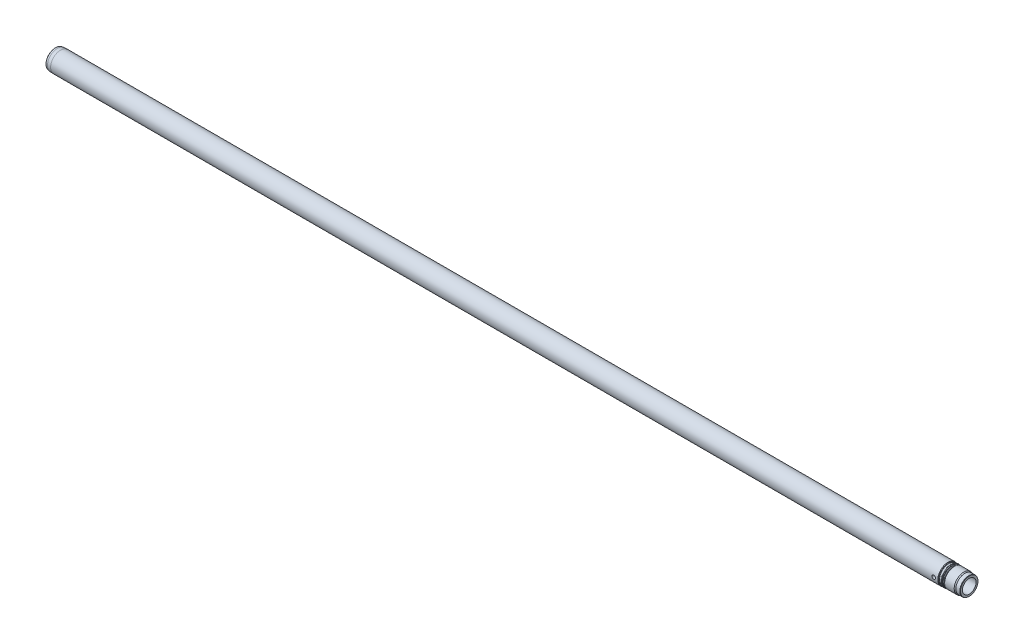
ISO-10303-21;
HEADER;
FILE_DESCRIPTION(('STEP AP214'),'2;1');
FILE_NAME('part.step','',(''),(''),'','','');
FILE_SCHEMA(('AUTOMOTIVE_DESIGN { 1 0 10303 214 1 1 1 1 }'));
ENDSEC;
DATA;
#1=APPLICATION_CONTEXT('core data for automotive mechanical design processes');
#2=APPLICATION_PROTOCOL_DEFINITION('international standard','automotive_design',2000,#1);
#3=PRODUCT_CONTEXT('',#1,'mechanical');
#4=PRODUCT('Part','Part','',(#3));
#5=PRODUCT_RELATED_PRODUCT_CATEGORY('part','',(#4));
#6=PRODUCT_DEFINITION_FORMATION('','',#4);
#7=PRODUCT_DEFINITION_CONTEXT('part definition',#1,'design');
#8=PRODUCT_DEFINITION('design','',#6,#7);
#9=PRODUCT_DEFINITION_SHAPE('','',#8);
#10=(LENGTH_UNIT() NAMED_UNIT(*) SI_UNIT(.MILLI.,.METRE.));
#11=(NAMED_UNIT(*) PLANE_ANGLE_UNIT() SI_UNIT($,.RADIAN.));
#12=(NAMED_UNIT(*) SI_UNIT($,.STERADIAN.) SOLID_ANGLE_UNIT());
#13=UNCERTAINTY_MEASURE_WITH_UNIT(LENGTH_MEASURE(1.E-05),#10,'distance_accuracy_value','');
#14=(GEOMETRIC_REPRESENTATION_CONTEXT(3) GLOBAL_UNCERTAINTY_ASSIGNED_CONTEXT((#13)) GLOBAL_UNIT_ASSIGNED_CONTEXT((#10,
#11,#12)) REPRESENTATION_CONTEXT('',''));
#15=CARTESIAN_POINT('',(0.,0.,0.));
#16=DIRECTION('',(0.,0.,1.));
#17=DIRECTION('',(1.,0.,0.));
#18=AXIS2_PLACEMENT_3D('',#15,#16,#17);
#19=CARTESIAN_POINT('',(0.,0.,0.));
#20=DIRECTION('',(-1.,0.,0.));
#21=DIRECTION('',(0.,0.,1.));
#22=AXIS2_PLACEMENT_3D('',#19,#20,#21);
#23=CONICAL_SURFACE('',#22,21.,0.5235987755983);
#24=CARTESIAN_POINT('',(6.9282032302755,0.,0.));
#25=DIRECTION('',(-1.,0.,0.));
#26=DIRECTION('',(0.,0.,1.));
#27=AXIS2_PLACEMENT_3D('',#24,#25,#26);
#28=CIRCLE('',#27,17.);
#29=CARTESIAN_POINT('',(6.9282032302755,0.,17.));
#30=VERTEX_POINT('',#29);
#31=EDGE_CURVE('E10',#30,#30,#28,.T.);
#32=ORIENTED_EDGE('',*,*,#31,.F.);
#33=EDGE_LOOP('',(#32));
#34=FACE_BOUND('',#33,.T.);
#35=CARTESIAN_POINT('',(0.,0.,0.));
#36=DIRECTION('',(-1.,0.,0.));
#37=DIRECTION('',(0.,0.,1.));
#38=AXIS2_PLACEMENT_3D('',#35,#36,#37);
#39=CIRCLE('',#38,21.);
#40=CARTESIAN_POINT('',(0.,0.,21.));
#41=VERTEX_POINT('',#40);
#42=EDGE_CURVE('E186',#41,#41,#39,.T.);
#43=ORIENTED_EDGE('',*,*,#42,.T.);
#44=EDGE_LOOP('',(#43));
#45=FACE_BOUND('',#44,.T.);
#46=ADVANCED_FACE('F43',(#34,#45),#23,.F.);
#47=CARTESIAN_POINT('',(0.,0.,0.));
#48=DIRECTION('',(-1.,0.,0.));
#49=DIRECTION('',(0.,0.,1.));
#50=AXIS2_PLACEMENT_3D('',#47,#48,#49);
#51=CYLINDRICAL_SURFACE('',#50,17.);
#52=CARTESIAN_POINT('',(2224.5,0.,17.));
#53=CARTESIAN_POINT('',(2224.4999939727,0.248139786094188,16.9999961954987));
#54=CARTESIAN_POINT('',(2224.47940671072,0.496344480536865,16.9945135114711));
#55=CARTESIAN_POINT('',(2224.39774465018,0.985608207524356,16.9731743158839));
#56=CARTESIAN_POINT('',(2224.33664995094,1.22666366691603,16.9573127053678));
#57=CARTESIAN_POINT('',(2224.17609514792,1.69449551647206,16.9169670511542));
#58=CARTESIAN_POINT('',(2224.07668410305,1.92128973608239,16.8924940366699));
#59=CARTESIAN_POINT('',(2223.8424992788,2.35498604639736,16.8375143452414));
#60=CARTESIAN_POINT('',(2223.70772328063,2.5618868878872,16.8070072897538));
#61=CARTESIAN_POINT('',(2223.40337915686,2.95465619368824,16.742475132348));
#62=CARTESIAN_POINT('',(2223.23315265612,3.14000475166011,16.7083905935436));
#63=CARTESIAN_POINT('',(2222.86414729992,3.47988446560821,16.6409282417729));
#64=CARTESIAN_POINT('',(2222.66536483098,3.63441171550888,16.607550518862));
#65=CARTESIAN_POINT('',(2222.24075395446,3.91078648059985,16.5446740227616));
#66=CARTESIAN_POINT('',(2222.01452540905,4.03203787997951,16.5152502963799));
#67=CARTESIAN_POINT('',(2221.54398909092,4.23458020510498,16.4644862931427));
#68=CARTESIAN_POINT('',(2221.29968460691,4.31587837939242,16.4431445501692));
#69=CARTESIAN_POINT('',(2220.80568432275,4.43440473399746,16.4115742230543));
#70=CARTESIAN_POINT('',(2220.55622997909,4.47257460052638,16.4011085907811));
#71=CARTESIAN_POINT('',(2220.05425585675,4.50669636392588,16.3917670522187));
#72=CARTESIAN_POINT('',(2219.80173665031,4.50265602438466,16.3928890146597));
#73=CARTESIAN_POINT('',(2219.30813487029,4.45322011969829,16.4063836229732));
#74=CARTESIAN_POINT('',(2219.06692858361,4.40896191779178,16.4184468321884));
#75=CARTESIAN_POINT('',(2218.59549324367,4.28216736951909,16.4519695301457));
#76=CARTESIAN_POINT('',(2218.36526505785,4.19962800383794,16.4734297600429));
#77=CARTESIAN_POINT('',(2217.91934632075,3.99768222492809,16.523602001098));
#78=CARTESIAN_POINT('',(2217.70384627049,3.87787539054613,16.5523921271919));
#79=CARTESIAN_POINT('',(2217.29560838492,3.60507498121206,16.6139379943505));
#80=CARTESIAN_POINT('',(2217.10287498213,3.45207496016856,16.6466945051375));
#81=CARTESIAN_POINT('',(2216.73914078256,3.11140669080729,16.713772135603));
#82=CARTESIAN_POINT('',(2216.5690368451,2.92278277301686,16.7481097163476));
#83=CARTESIAN_POINT('',(2216.2626934722,2.51926736973084,16.8135364031182));
#84=CARTESIAN_POINT('',(2216.12645533296,2.30437487928068,16.8446253847784));
#85=CARTESIAN_POINT('',(2215.89132397923,1.85304666357204,16.9002386163944));
#86=CARTESIAN_POINT('',(2215.79259105471,1.61652371530395,16.9247345619698));
#87=CARTESIAN_POINT('',(2215.63654666082,1.12944054429492,16.9641969693574));
#88=CARTESIAN_POINT('',(2215.57922627709,0.878883355042779,16.9791654819339));
#89=CARTESIAN_POINT('',(2215.50903761317,0.378499758438339,16.9975771452599));
#90=CARTESIAN_POINT('',(2215.49494974273,0.128855796723682,17.0013364198685));
#91=CARTESIAN_POINT('',(2215.50826073824,-0.369227077901234,16.9978138879051));
#92=CARTESIAN_POINT('',(2215.53565538363,-0.617666110824332,16.9905332045683));
#93=CARTESIAN_POINT('',(2215.63015281242,-1.10194782952378,16.9659528174809));
#94=CARTESIAN_POINT('',(2215.69657714815,-1.33793239097633,16.948824402433));
#95=CARTESIAN_POINT('',(2215.86646212655,-1.79538752946404,16.9064898967348));
#96=CARTESIAN_POINT('',(2215.96992675219,-2.0168565426002,16.8812829374232));
#97=CARTESIAN_POINT('',(2216.21322970176,-2.44374648563431,16.8248446875655));
#98=CARTESIAN_POINT('',(2216.35373386753,-2.64877339136345,16.7935061472465));
#99=CARTESIAN_POINT('',(2216.66628874917,-3.03276827772532,16.7284282285678));
#100=CARTESIAN_POINT('',(2216.83834560154,-3.21173117715732,16.6946883839752));
#101=CARTESIAN_POINT('',(2217.21480997561,-3.54364355494941,16.6274504542847));
#102=CARTESIAN_POINT('',(2217.41998287879,-3.69573311976482,16.5939850732425));
#103=CARTESIAN_POINT('',(2217.8536440921,-3.96333980003506,16.5321164485773));
#104=CARTESIAN_POINT('',(2218.08213141823,-4.07885845816123,16.5037129914492));
#105=CARTESIAN_POINT('',(2218.55478257722,-4.26917454350183,16.4555094596446));
#106=CARTESIAN_POINT('',(2218.79884568015,-4.34420881494308,16.4356594855548));
#107=CARTESIAN_POINT('',(2219.29673856418,-4.45199494844995,16.406794736422));
#108=CARTESIAN_POINT('',(2219.55056587738,-4.48475742334335,16.397777241798));
#109=CARTESIAN_POINT('',(2220.05198474975,-4.50646611717172,16.3918232507794));
#110=CARTESIAN_POINT('',(2220.29951289327,-4.49679348202494,16.3945059290146));
#111=CARTESIAN_POINT('',(2220.78927335167,-4.43710513576492,16.4107597380705));
#112=CARTESIAN_POINT('',(2221.03150579891,-4.3870904341136,16.424330596441));
#113=CARTESIAN_POINT('',(2221.50208906434,-4.24893296579963,16.4606067002153));
#114=CARTESIAN_POINT('',(2221.73053032532,-4.16107880659365,16.4832427143121));
#115=CARTESIAN_POINT('',(2222.16960250499,-3.94996082547752,16.5351012194014));
#116=CARTESIAN_POINT('',(2222.38023066107,-3.82669152406759,16.5643247294733));
#117=CARTESIAN_POINT('',(2222.78430015737,-3.54403917830613,16.6271251137983));
#118=CARTESIAN_POINT('',(2222.97706513554,-3.38371171107488,16.6608037314858));
#119=CARTESIAN_POINT('',(2223.33340368922,-3.03329563019939,16.7281467874236));
#120=CARTESIAN_POINT('',(2223.49697017825,-2.84319981272947,16.7618112202589));
#121=CARTESIAN_POINT('',(2223.79363954504,-2.43382938444725,16.826177392179));
#122=CARTESIAN_POINT('',(2223.92603111348,-2.21402616883131,16.8568021342467));
#123=CARTESIAN_POINT('',(2224.15177475838,-1.75448140910157,16.9107999106154));
#124=CARTESIAN_POINT('',(2224.24515224208,-1.51475296330053,16.9341776618239));
#125=CARTESIAN_POINT('',(2224.37783337599,-1.0632142420448,16.9679716718454));
#126=CARTESIAN_POINT('',(2224.42354035917,-0.853375925202503,16.9798953831305));
#127=CARTESIAN_POINT('',(2224.48462482595,-0.429040947974681,16.9959108172613));
#128=CARTESIAN_POINT('',(2224.50000521128,-0.214544735254492,17.000003289419));
#129=CARTESIAN_POINT('',(2224.5,0.,17.));
#130=B_SPLINE_CURVE_WITH_KNOTS('',3,(#52,#53,#54,#55,#56,#57,#58,#59,#60,#61,#62,#63,#64,#65,
#66,#67,#68,#69,#70,#71,#72,#73,#74,#75,#76,#77,#78,#79,#80,#81,#82,#83,#84,#85,#86,#87,#88,#89,
#90,#91,#92,#93,#94,#95,#96,#97,#98,#99,#100,#101,#102,#103,#104,#105,#106,#107,#108,#109,#110,
#111,#112,#113,#114,#115,#116,#117,#118,#119,#120,#121,#122,#123,#124,#125,#126,#127,#128,#129),
.UNSPECIFIED.,.T.,.F.,(4,2,2,2,2,2,2,2,2,2,2,2,2,2,2,2,2,2,2,2,2,2,2,2,2,2,2,2,2,2,2,2,2,2,2,2,
2,2,4),(0.,0.743632635950748,1.48763087813262,2.23067967867761,2.97377510891816,
3.73214910607012,4.49061915321903,5.26190121593442,6.03304329655962,6.78700122339545,
7.54082047960318,8.27396339050142,9.00716413574138,9.74853201191116,10.4900439902362,
11.2553725952916,12.0207304886276,12.7893235247107,13.5577510664168,14.3042921594799,
15.0507573025269,15.7846153421825,16.5185523178614,17.2667079864015,18.0150093138617,
18.7840807596342,19.5531197593254,20.3176095059617,21.0819072811555,21.8215171089269,
22.5611084303385,23.2951559815246,24.0293171671978,24.7847891506871,25.5404442388059,
26.3119567618966,27.0829660649108,27.7259815891753,28.3689355850576),.UNSPECIFIED.);
#131=CARTESIAN_POINT('',(2224.5,0.,17.));
#132=VERTEX_POINT('',#131);
#133=EDGE_CURVE('E90',#132,#132,#130,.T.);
#134=ORIENTED_EDGE('',*,*,#133,.T.);
#135=EDGE_LOOP('',(#134));
#136=FACE_BOUND('',#135,.T.);
#137=CARTESIAN_POINT('',(2224.5,0.,-17.));
#138=CARTESIAN_POINT('',(2224.4999939727,-0.248139786094188,-16.9999961954987));
#139=CARTESIAN_POINT('',(2224.47940671072,-0.496344480536865,-16.9945135114711));
#140=CARTESIAN_POINT('',(2224.39774465018,-0.985608207524356,-16.9731743158839));
#141=CARTESIAN_POINT('',(2224.33664995094,-1.22666366691603,-16.9573127053678));
#142=CARTESIAN_POINT('',(2224.17609514792,-1.69449551647206,-16.9169670511542));
#143=CARTESIAN_POINT('',(2224.07668410305,-1.92128973608239,-16.8924940366699));
#144=CARTESIAN_POINT('',(2223.8424992788,-2.35498604639736,-16.8375143452414));
#145=CARTESIAN_POINT('',(2223.70772328063,-2.5618868878872,-16.8070072897538));
#146=CARTESIAN_POINT('',(2223.40337915686,-2.95465619368824,-16.742475132348));
#147=CARTESIAN_POINT('',(2223.23315265612,-3.14000475166011,-16.7083905935436));
#148=CARTESIAN_POINT('',(2222.86414729992,-3.47988446560821,-16.6409282417729));
#149=CARTESIAN_POINT('',(2222.66536483098,-3.63441171550888,-16.607550518862));
#150=CARTESIAN_POINT('',(2222.24075395446,-3.91078648059985,-16.5446740227616));
#151=CARTESIAN_POINT('',(2222.01452540905,-4.03203787997951,-16.5152502963799));
#152=CARTESIAN_POINT('',(2221.54398909092,-4.23458020510498,-16.4644862931427));
#153=CARTESIAN_POINT('',(2221.29968460691,-4.31587837939242,-16.4431445501692));
#154=CARTESIAN_POINT('',(2220.80568432275,-4.43440473399746,-16.4115742230543));
#155=CARTESIAN_POINT('',(2220.55622997909,-4.47257460052638,-16.4011085907811));
#156=CARTESIAN_POINT('',(2220.05425585675,-4.50669636392588,-16.3917670522187));
#157=CARTESIAN_POINT('',(2219.80173665031,-4.50265602438466,-16.3928890146597));
#158=CARTESIAN_POINT('',(2219.30813487029,-4.45322011969829,-16.4063836229732));
#159=CARTESIAN_POINT('',(2219.06692858361,-4.40896191779178,-16.4184468321884));
#160=CARTESIAN_POINT('',(2218.59549324367,-4.28216736951909,-16.4519695301457));
#161=CARTESIAN_POINT('',(2218.36526505785,-4.19962800383794,-16.4734297600429));
#162=CARTESIAN_POINT('',(2217.91934632075,-3.99768222492809,-16.523602001098));
#163=CARTESIAN_POINT('',(2217.70384627049,-3.87787539054613,-16.5523921271919));
#164=CARTESIAN_POINT('',(2217.29560838492,-3.60507498121206,-16.6139379943505));
#165=CARTESIAN_POINT('',(2217.10287498213,-3.45207496016856,-16.6466945051375));
#166=CARTESIAN_POINT('',(2216.73914078256,-3.11140669080729,-16.713772135603));
#167=CARTESIAN_POINT('',(2216.5690368451,-2.92278277301686,-16.7481097163476));
#168=CARTESIAN_POINT('',(2216.2626934722,-2.51926736973084,-16.8135364031182));
#169=CARTESIAN_POINT('',(2216.12645533296,-2.30437487928068,-16.8446253847784));
#170=CARTESIAN_POINT('',(2215.89132397923,-1.85304666357204,-16.9002386163944));
#171=CARTESIAN_POINT('',(2215.79259105471,-1.61652371530395,-16.9247345619698));
#172=CARTESIAN_POINT('',(2215.63654666082,-1.12944054429492,-16.9641969693574));
#173=CARTESIAN_POINT('',(2215.57922627709,-0.878883355042779,-16.9791654819339));
#174=CARTESIAN_POINT('',(2215.50903761317,-0.378499758438339,-16.9975771452599));
#175=CARTESIAN_POINT('',(2215.49494974273,-0.128855796723682,-17.0013364198685));
#176=CARTESIAN_POINT('',(2215.50826073824,0.369227077901234,-16.9978138879051));
#177=CARTESIAN_POINT('',(2215.53565538363,0.617666110824332,-16.9905332045683));
#178=CARTESIAN_POINT('',(2215.63015281242,1.10194782952378,-16.9659528174809));
#179=CARTESIAN_POINT('',(2215.69657714815,1.33793239097633,-16.948824402433));
#180=CARTESIAN_POINT('',(2215.86646212655,1.79538752946404,-16.9064898967348));
#181=CARTESIAN_POINT('',(2215.96992675219,2.0168565426002,-16.8812829374232));
#182=CARTESIAN_POINT('',(2216.21322970176,2.44374648563431,-16.8248446875655));
#183=CARTESIAN_POINT('',(2216.35373386753,2.64877339136345,-16.7935061472465));
#184=CARTESIAN_POINT('',(2216.66628874917,3.03276827772532,-16.7284282285678));
#185=CARTESIAN_POINT('',(2216.83834560154,3.21173117715732,-16.6946883839752));
#186=CARTESIAN_POINT('',(2217.21480997561,3.54364355494941,-16.6274504542847));
#187=CARTESIAN_POINT('',(2217.41998287879,3.69573311976482,-16.5939850732425));
#188=CARTESIAN_POINT('',(2217.8536440921,3.96333980003506,-16.5321164485773));
#189=CARTESIAN_POINT('',(2218.08213141823,4.07885845816123,-16.5037129914492));
#190=CARTESIAN_POINT('',(2218.55478257722,4.26917454350183,-16.4555094596446));
#191=CARTESIAN_POINT('',(2218.79884568015,4.34420881494308,-16.4356594855548));
#192=CARTESIAN_POINT('',(2219.29673856418,4.45199494844995,-16.406794736422));
#193=CARTESIAN_POINT('',(2219.55056587738,4.48475742334335,-16.397777241798));
#194=CARTESIAN_POINT('',(2220.05198474975,4.50646611717172,-16.3918232507794));
#195=CARTESIAN_POINT('',(2220.29951289327,4.49679348202494,-16.3945059290146));
#196=CARTESIAN_POINT('',(2220.78927335167,4.43710513576492,-16.4107597380705));
#197=CARTESIAN_POINT('',(2221.03150579891,4.3870904341136,-16.424330596441));
#198=CARTESIAN_POINT('',(2221.50208906434,4.24893296579963,-16.4606067002153));
#199=CARTESIAN_POINT('',(2221.73053032532,4.16107880659365,-16.4832427143121));
#200=CARTESIAN_POINT('',(2222.16960250499,3.94996082547752,-16.5351012194014));
#201=CARTESIAN_POINT('',(2222.38023066107,3.82669152406759,-16.5643247294733));
#202=CARTESIAN_POINT('',(2222.78430015737,3.54403917830613,-16.6271251137983));
#203=CARTESIAN_POINT('',(2222.97706513554,3.38371171107488,-16.6608037314858));
#204=CARTESIAN_POINT('',(2223.33340368922,3.03329563019939,-16.7281467874236));
#205=CARTESIAN_POINT('',(2223.49697017825,2.84319981272947,-16.7618112202589));
#206=CARTESIAN_POINT('',(2223.79363954504,2.43382938444725,-16.826177392179));
#207=CARTESIAN_POINT('',(2223.92603111348,2.21402616883131,-16.8568021342467));
#208=CARTESIAN_POINT('',(2224.15177475838,1.75448140910157,-16.9107999106154));
#209=CARTESIAN_POINT('',(2224.24515224208,1.51475296330053,-16.9341776618239));
#210=CARTESIAN_POINT('',(2224.37783337599,1.0632142420448,-16.9679716718454));
#211=CARTESIAN_POINT('',(2224.42354035917,0.853375925202503,-16.9798953831305));
#212=CARTESIAN_POINT('',(2224.48462482595,0.429040947974681,-16.9959108172613));
#213=CARTESIAN_POINT('',(2224.50000521128,0.214544735254492,-17.000003289419));
#214=CARTESIAN_POINT('',(2224.5,0.,-17.));
#215=B_SPLINE_CURVE_WITH_KNOTS('',3,(#137,#138,#139,#140,#141,#142,#143,#144,#145,#146,#147,
#148,#149,#150,#151,#152,#153,#154,#155,#156,#157,#158,#159,#160,#161,#162,#163,#164,#165,#166,
#167,#168,#169,#170,#171,#172,#173,#174,#175,#176,#177,#178,#179,#180,#181,#182,#183,#184,#185,
#186,#187,#188,#189,#190,#191,#192,#193,#194,#195,#196,#197,#198,#199,#200,#201,#202,#203,#204,
#205,#206,#207,#208,#209,#210,#211,#212,#213,#214),.UNSPECIFIED.,.T.,.F.,(4,2,2,2,2,2,2,2,2,2,2,
2,2,2,2,2,2,2,2,2,2,2,2,2,2,2,2,2,2,2,2,2,2,2,2,2,2,2,4),(0.,0.743632635950748,1.48763087813262,
2.23067967867761,2.97377510891816,3.73214910607012,4.49061915321903,5.26190121593442,
6.03304329655962,6.78700122339545,7.54082047960318,8.27396339050142,9.00716413574138,
9.74853201191116,10.4900439902362,11.2553725952916,12.0207304886276,12.7893235247107,
13.5577510664168,14.3042921594799,15.0507573025269,15.7846153421825,16.5185523178614,
17.2667079864015,18.0150093138617,18.7840807596342,19.5531197593254,20.3176095059617,
21.0819072811555,21.8215171089269,22.5611084303385,23.2951559815246,24.0293171671978,
24.7847891506871,25.5404442388059,26.3119567618966,27.0829660649108,27.7259815891753,
28.3689355850576),.UNSPECIFIED.);
#216=CARTESIAN_POINT('',(2224.5,0.,-17.));
#217=VERTEX_POINT('',#216);
#218=EDGE_CURVE('E85',#217,#217,#215,.T.);
#219=ORIENTED_EDGE('',*,*,#218,.T.);
#220=EDGE_LOOP('',(#219));
#221=FACE_BOUND('',#220,.T.);
#222=CARTESIAN_POINT('',(2284.,0.,0.));
#223=DIRECTION('',(-1.,0.,0.));
#224=DIRECTION('',(0.,0.,1.));
#225=AXIS2_PLACEMENT_3D('',#222,#223,#224);
#226=CIRCLE('',#225,17.);
#227=CARTESIAN_POINT('',(2284.,0.,17.));
#228=VERTEX_POINT('',#227);
#229=EDGE_CURVE('E55',#228,#228,#226,.T.);
#230=ORIENTED_EDGE('',*,*,#229,.F.);
#231=EDGE_LOOP('',(#230));
#232=FACE_BOUND('',#231,.T.);
#233=ORIENTED_EDGE('',*,*,#31,.T.);
#234=EDGE_LOOP('',(#233));
#235=FACE_BOUND('',#234,.T.);
#236=ADVANCED_FACE('F95',(#136,#221,#232,#235),#51,.F.);
#237=CARTESIAN_POINT('',(2284.,21.9226497308105,0.));
#238=DIRECTION('',(1.,0.,0.));
#239=DIRECTION('',(0.,0.,-1.));
#240=AXIS2_PLACEMENT_3D('',#237,#238,#239);
#241=PLANE('',#240);
#242=ORIENTED_EDGE('',*,*,#229,.T.);
#243=EDGE_LOOP('',(#242));
#244=FACE_BOUND('',#243,.T.);
#245=CARTESIAN_POINT('',(2284.,0.,0.));
#246=DIRECTION('',(-1.,0.,0.));
#247=DIRECTION('',(0.,0.,1.));
#248=AXIS2_PLACEMENT_3D('',#245,#246,#247);
#249=CIRCLE('',#248,21.9226497308105);
#250=CARTESIAN_POINT('',(2284.,0.,21.9226497308105));
#251=VERTEX_POINT('',#250);
#252=EDGE_CURVE('E60',#251,#251,#249,.T.);
#253=ORIENTED_EDGE('',*,*,#252,.F.);
#254=EDGE_LOOP('',(#253));
#255=FACE_BOUND('',#254,.T.);
#256=ADVANCED_FACE('F99',(#244,#255),#241,.T.);
#257=CARTESIAN_POINT('',(2284.,0.,0.));
#258=DIRECTION('',(-1.,0.,0.));
#259=DIRECTION('',(0.,0.,1.));
#260=AXIS2_PLACEMENT_3D('',#257,#258,#259);
#261=CONICAL_SURFACE('',#260,21.9226497308105,0.52359877559829);
#262=CARTESIAN_POINT('',(2283.,0.,0.));
#263=DIRECTION('',(-1.,0.,0.));
#264=DIRECTION('',(0.,0.,1.));
#265=AXIS2_PLACEMENT_3D('',#262,#263,#264);
#266=CIRCLE('',#265,22.5);
#267=CARTESIAN_POINT('',(2283.,0.,22.5));
#268=VERTEX_POINT('',#267);
#269=EDGE_CURVE('E255',#268,#268,#266,.T.);
#270=ORIENTED_EDGE('',*,*,#269,.F.);
#271=EDGE_LOOP('',(#270));
#272=FACE_BOUND('',#271,.T.);
#273=ORIENTED_EDGE('',*,*,#252,.T.);
#274=EDGE_LOOP('',(#273));
#275=FACE_BOUND('',#274,.T.);
#276=ADVANCED_FACE('F104',(#272,#275),#261,.T.);
#277=CARTESIAN_POINT('',(0.,0.,0.));
#278=DIRECTION('',(-1.,0.,0.));
#279=DIRECTION('',(0.,0.,1.));
#280=AXIS2_PLACEMENT_3D('',#277,#278,#279);
#281=CYLINDRICAL_SURFACE('',#280,22.5);
#282=CARTESIAN_POINT('',(2273.,0.,0.));
#283=DIRECTION('',(-1.,0.,0.));
#284=DIRECTION('',(0.,0.,1.));
#285=AXIS2_PLACEMENT_3D('',#282,#283,#284);
#286=CIRCLE('',#285,22.5);
#287=CARTESIAN_POINT('',(2273.,0.,22.5));
#288=VERTEX_POINT('',#287);
#289=EDGE_CURVE('E252',#288,#288,#286,.T.);
#290=ORIENTED_EDGE('',*,*,#289,.F.);
#291=EDGE_LOOP('',(#290));
#292=FACE_BOUND('',#291,.T.);
#293=ORIENTED_EDGE('',*,*,#269,.T.);
#294=EDGE_LOOP('',(#293));
#295=FACE_BOUND('',#294,.T.);
#296=ADVANCED_FACE('F108',(#292,#295),#281,.T.);
#297=CARTESIAN_POINT('',(2273.,0.,0.));
#298=DIRECTION('',(-1.,0.,0.));
#299=DIRECTION('',(0.,0.,1.));
#300=AXIS2_PLACEMENT_3D('',#297,#298,#299);
#301=CONICAL_SURFACE('',#300,22.5,0.523598775598331);
#302=CARTESIAN_POINT('',(2270.40192378865,0.,0.));
#303=DIRECTION('',(-1.,0.,0.));
#304=DIRECTION('',(0.,0.,1.));
#305=AXIS2_PLACEMENT_3D('',#302,#303,#304);
#306=CIRCLE('',#305,24.);
#307=CARTESIAN_POINT('',(2270.40192378865,0.,24.));
#308=VERTEX_POINT('',#307);
#309=EDGE_CURVE('E249',#308,#308,#306,.T.);
#310=ORIENTED_EDGE('',*,*,#309,.F.);
#311=EDGE_LOOP('',(#310));
#312=FACE_BOUND('',#311,.T.);
#313=ORIENTED_EDGE('',*,*,#289,.T.);
#314=EDGE_LOOP('',(#313));
#315=FACE_BOUND('',#314,.T.);
#316=ADVANCED_FACE('F112',(#312,#315),#301,.T.);
#317=CARTESIAN_POINT('',(0.,0.,0.));
#318=DIRECTION('',(-1.,0.,0.));
#319=DIRECTION('',(0.,0.,1.));
#320=AXIS2_PLACEMENT_3D('',#317,#318,#319);
#321=CYLINDRICAL_SURFACE('',#320,24.);
#322=ORIENTED_EDGE('',*,*,#309,.T.);
#323=EDGE_LOOP('',(#322));
#324=FACE_BOUND('',#323,.T.);
#325=CARTESIAN_POINT('',(2246.45326313188,0.,0.));
#326=DIRECTION('',(-1.,0.,0.));
#327=DIRECTION('',(0.,0.,1.));
#328=AXIS2_PLACEMENT_3D('',#325,#326,#327);
#329=CIRCLE('',#328,24.);
#330=CARTESIAN_POINT('',(2246.45326313188,0.,24.));
#331=VERTEX_POINT('',#330);
#332=EDGE_CURVE('E246',#331,#331,#329,.T.);
#333=ORIENTED_EDGE('',*,*,#332,.F.);
#334=EDGE_LOOP('',(#333));
#335=FACE_BOUND('',#334,.T.);
#336=ADVANCED_FACE('F116',(#324,#335),#321,.T.);
#337=CARTESIAN_POINT('',(2244.,0.,0.));
#338=DIRECTION('',(1.,0.,0.));
#339=DIRECTION('',(0.,0.,-1.));
#340=AXIS2_PLACEMENT_3D('',#337,#338,#339);
#341=CONICAL_SURFACE('',#340,22.75,0.471238898038433);
#342=ORIENTED_EDGE('',*,*,#332,.T.);
#343=EDGE_LOOP('',(#342));
#344=FACE_BOUND('',#343,.T.);
#345=CARTESIAN_POINT('',(2244.,0.,0.));
#346=DIRECTION('',(-1.,0.,0.));
#347=DIRECTION('',(0.,0.,1.));
#348=AXIS2_PLACEMENT_3D('',#345,#346,#347);
#349=CIRCLE('',#348,22.75);
#350=CARTESIAN_POINT('',(2244.,0.,22.75));
#351=VERTEX_POINT('',#350);
#352=EDGE_CURVE('E243',#351,#351,#349,.T.);
#353=ORIENTED_EDGE('',*,*,#352,.F.);
#354=EDGE_LOOP('',(#353));
#355=FACE_BOUND('',#354,.T.);
#356=ADVANCED_FACE('F120',(#344,#355),#341,.T.);
#357=CARTESIAN_POINT('',(0.,0.,0.));
#358=DIRECTION('',(-1.,0.,0.));
#359=DIRECTION('',(0.,0.,1.));
#360=AXIS2_PLACEMENT_3D('',#357,#358,#359);
#361=CYLINDRICAL_SURFACE('',#360,22.75);
#362=ORIENTED_EDGE('',*,*,#352,.T.);
#363=EDGE_LOOP('',(#362));
#364=FACE_BOUND('',#363,.T.);
#365=CARTESIAN_POINT('',(2241.8,0.,0.));
#366=DIRECTION('',(-1.,0.,0.));
#367=DIRECTION('',(0.,0.,1.));
#368=AXIS2_PLACEMENT_3D('',#365,#366,#367);
#369=CIRCLE('',#368,22.75);
#370=CARTESIAN_POINT('',(2241.8,0.,22.75));
#371=VERTEX_POINT('',#370);
#372=EDGE_CURVE('E240',#371,#371,#369,.T.);
#373=ORIENTED_EDGE('',*,*,#372,.F.);
#374=EDGE_LOOP('',(#373));
#375=FACE_BOUND('',#374,.T.);
#376=ADVANCED_FACE('F124',(#364,#375),#361,.T.);
#377=CARTESIAN_POINT('',(2241.8,0.,0.));
#378=DIRECTION('',(-1.,0.,0.));
#379=DIRECTION('',(0.,0.,1.));
#380=AXIS2_PLACEMENT_3D('',#377,#378,#379);
#381=TOROIDAL_SURFACE('',#380,23.55,0.799999999999955);
#382=ORIENTED_EDGE('',*,*,#372,.T.);
#383=EDGE_LOOP('',(#382));
#384=FACE_BOUND('',#383,.T.);
#385=CARTESIAN_POINT('',(2241.,0.,0.));
#386=DIRECTION('',(-1.,0.,0.));
#387=DIRECTION('',(0.,0.,1.));
#388=AXIS2_PLACEMENT_3D('',#385,#386,#387);
#389=CIRCLE('',#388,23.55);
#390=CARTESIAN_POINT('',(2241.,0.,23.55));
#391=VERTEX_POINT('',#390);
#392=EDGE_CURVE('E237',#391,#391,#389,.T.);
#393=ORIENTED_EDGE('',*,*,#392,.F.);
#394=EDGE_LOOP('',(#393));
#395=FACE_BOUND('',#394,.T.);
#396=ADVANCED_FACE('F128',(#384,#395),#381,.F.);
#397=CARTESIAN_POINT('',(2241.,23.8839745962155,0.));
#398=DIRECTION('',(1.,0.,0.));
#399=DIRECTION('',(0.,0.,-1.));
#400=AXIS2_PLACEMENT_3D('',#397,#398,#399);
#401=PLANE('',#400);
#402=ORIENTED_EDGE('',*,*,#392,.T.);
#403=EDGE_LOOP('',(#402));
#404=FACE_BOUND('',#403,.T.);
#405=CARTESIAN_POINT('',(2241.,0.,0.));
#406=DIRECTION('',(-1.,0.,0.));
#407=DIRECTION('',(0.,0.,1.));
#408=AXIS2_PLACEMENT_3D('',#405,#406,#407);
#409=CIRCLE('',#408,23.8839745962155);
#410=CARTESIAN_POINT('',(2241.,0.,23.8839745962155));
#411=VERTEX_POINT('',#410);
#412=EDGE_CURVE('E234',#411,#411,#409,.T.);
#413=ORIENTED_EDGE('',*,*,#412,.F.);
#414=EDGE_LOOP('',(#413));
#415=FACE_BOUND('',#414,.T.);
#416=ADVANCED_FACE('F132',(#404,#415),#401,.T.);
#417=CARTESIAN_POINT('',(2239.5,0.,0.));
#418=DIRECTION('',(-1.,0.,0.));
#419=DIRECTION('',(0.,0.,1.));
#420=AXIS2_PLACEMENT_3D('',#417,#418,#419);
#421=CONICAL_SURFACE('',#420,24.75,0.5235987755983);
#422=ORIENTED_EDGE('',*,*,#412,.T.);
#423=EDGE_LOOP('',(#422));
#424=FACE_BOUND('',#423,.T.);
#425=CARTESIAN_POINT('',(2239.5,0.,0.));
#426=DIRECTION('',(-1.,0.,0.));
#427=DIRECTION('',(0.,0.,1.));
#428=AXIS2_PLACEMENT_3D('',#425,#426,#427);
#429=CIRCLE('',#428,24.75);
#430=CARTESIAN_POINT('',(2239.5,0.,24.75));
#431=VERTEX_POINT('',#430);
#432=EDGE_CURVE('E231',#431,#431,#429,.T.);
#433=ORIENTED_EDGE('',*,*,#432,.F.);
#434=EDGE_LOOP('',(#433));
#435=FACE_BOUND('',#434,.T.);
#436=ADVANCED_FACE('F136',(#424,#435),#421,.T.);
#437=CARTESIAN_POINT('',(0.,0.,0.));
#438=DIRECTION('',(-1.,0.,0.));
#439=DIRECTION('',(0.,0.,1.));
#440=AXIS2_PLACEMENT_3D('',#437,#438,#439);
#441=CYLINDRICAL_SURFACE('',#440,24.75);
#442=ORIENTED_EDGE('',*,*,#432,.T.);
#443=EDGE_LOOP('',(#442));
#444=FACE_BOUND('',#443,.T.);
#445=CARTESIAN_POINT('',(2238.5,0.,0.));
#446=DIRECTION('',(-1.,0.,0.));
#447=DIRECTION('',(0.,0.,1.));
#448=AXIS2_PLACEMENT_3D('',#445,#446,#447);
#449=CIRCLE('',#448,24.7500000000001);
#450=CARTESIAN_POINT('',(2238.5,0.,24.7500000000001));
#451=VERTEX_POINT('',#450);
#452=EDGE_CURVE('E228',#451,#451,#449,.T.);
#453=ORIENTED_EDGE('',*,*,#452,.F.);
#454=EDGE_LOOP('',(#453));
#455=FACE_BOUND('',#454,.T.);
#456=ADVANCED_FACE('F140',(#444,#455),#441,.T.);
#457=CARTESIAN_POINT('',(2238.5,0.,0.));
#458=DIRECTION('',(-1.,0.,0.));
#459=DIRECTION('',(0.,0.,1.));
#460=AXIS2_PLACEMENT_3D('',#457,#458,#459);
#461=TOROIDAL_SURFACE('',#460,24.25,0.500000000000084);
#462=CARTESIAN_POINT('',(2238.,0.,0.));
#463=DIRECTION('',(-1.,0.,0.));
#464=DIRECTION('',(0.,0.,1.));
#465=AXIS2_PLACEMENT_3D('',#462,#463,#464);
#466=CIRCLE('',#465,24.25);
#467=CARTESIAN_POINT('',(2238.,0.,24.25));
#468=VERTEX_POINT('',#467);
#469=EDGE_CURVE('E225',#468,#468,#466,.T.);
#470=ORIENTED_EDGE('',*,*,#469,.F.);
#471=EDGE_LOOP('',(#470));
#472=FACE_BOUND('',#471,.T.);
#473=ORIENTED_EDGE('',*,*,#452,.T.);
#474=EDGE_LOOP('',(#473));
#475=FACE_BOUND('',#474,.T.);
#476=ADVANCED_FACE('F144',(#472,#475),#461,.T.);
#477=CARTESIAN_POINT('',(2238.,23.8,0.));
#478=DIRECTION('',(-1.,0.,0.));
#479=DIRECTION('',(0.,0.,1.));
#480=AXIS2_PLACEMENT_3D('',#477,#478,#479);
#481=PLANE('',#480);
#482=ORIENTED_EDGE('',*,*,#469,.T.);
#483=EDGE_LOOP('',(#482));
#484=FACE_BOUND('',#483,.T.);
#485=CARTESIAN_POINT('',(2238.,0.,0.));
#486=DIRECTION('',(-1.,0.,0.));
#487=DIRECTION('',(0.,0.,1.));
#488=AXIS2_PLACEMENT_3D('',#485,#486,#487);
#489=CIRCLE('',#488,23.8);
#490=CARTESIAN_POINT('',(2238.,0.,23.8));
#491=VERTEX_POINT('',#490);
#492=EDGE_CURVE('E222',#491,#491,#489,.T.);
#493=ORIENTED_EDGE('',*,*,#492,.F.);
#494=EDGE_LOOP('',(#493));
#495=FACE_BOUND('',#494,.T.);
#496=ADVANCED_FACE('F148',(#484,#495),#481,.T.);
#497=CARTESIAN_POINT('',(2237.2,0.,0.));
#498=DIRECTION('',(-1.,0.,0.));
#499=DIRECTION('',(0.,0.,1.));
#500=AXIS2_PLACEMENT_3D('',#497,#498,#499);
#501=TOROIDAL_SURFACE('',#500,23.8,0.799999999999955);
#502=ORIENTED_EDGE('',*,*,#492,.T.);
#503=EDGE_LOOP('',(#502));
#504=FACE_BOUND('',#503,.T.);
#505=CARTESIAN_POINT('',(2237.2,0.,0.));
#506=DIRECTION('',(-1.,0.,0.));
#507=DIRECTION('',(0.,0.,1.));
#508=AXIS2_PLACEMENT_3D('',#505,#506,#507);
#509=CIRCLE('',#508,23.);
#510=CARTESIAN_POINT('',(2237.2,0.,23.));
#511=VERTEX_POINT('',#510);
#512=EDGE_CURVE('E219',#511,#511,#509,.T.);
#513=ORIENTED_EDGE('',*,*,#512,.F.);
#514=EDGE_LOOP('',(#513));
#515=FACE_BOUND('',#514,.T.);
#516=ADVANCED_FACE('F152',(#504,#515),#501,.F.);
#517=CARTESIAN_POINT('',(0.,0.,0.));
#518=DIRECTION('',(-1.,0.,0.));
#519=DIRECTION('',(0.,0.,1.));
#520=AXIS2_PLACEMENT_3D('',#517,#518,#519);
#521=CYLINDRICAL_SURFACE('',#520,22.9999999999999);
#522=ORIENTED_EDGE('',*,*,#512,.T.);
#523=EDGE_LOOP('',(#522));
#524=FACE_BOUND('',#523,.T.);
#525=CARTESIAN_POINT('',(2232.8,0.,0.));
#526=DIRECTION('',(-1.,0.,0.));
#527=DIRECTION('',(0.,0.,1.));
#528=AXIS2_PLACEMENT_3D('',#525,#526,#527);
#529=CIRCLE('',#528,22.9999999999998);
#530=CARTESIAN_POINT('',(2232.8,0.,22.9999999999998));
#531=VERTEX_POINT('',#530);
#532=EDGE_CURVE('E216',#531,#531,#529,.T.);
#533=ORIENTED_EDGE('',*,*,#532,.F.);
#534=EDGE_LOOP('',(#533));
#535=FACE_BOUND('',#534,.T.);
#536=ADVANCED_FACE('F156',(#524,#535),#521,.T.);
#537=CARTESIAN_POINT('',(2232.8,0.,0.));
#538=DIRECTION('',(-1.,0.,0.));
#539=DIRECTION('',(0.,0.,1.));
#540=AXIS2_PLACEMENT_3D('',#537,#538,#539);
#541=TOROIDAL_SURFACE('',#540,23.8,0.800000000000176);
#542=ORIENTED_EDGE('',*,*,#532,.T.);
#543=EDGE_LOOP('',(#542));
#544=FACE_BOUND('',#543,.T.);
#545=CARTESIAN_POINT('',(2232.,0.,0.));
#546=DIRECTION('',(-1.,0.,0.));
#547=DIRECTION('',(0.,0.,1.));
#548=AXIS2_PLACEMENT_3D('',#545,#546,#547);
#549=CIRCLE('',#548,23.8);
#550=CARTESIAN_POINT('',(2232.,0.,23.8));
#551=VERTEX_POINT('',#550);
#552=EDGE_CURVE('E213',#551,#551,#549,.T.);
#553=ORIENTED_EDGE('',*,*,#552,.F.);
#554=EDGE_LOOP('',(#553));
#555=FACE_BOUND('',#554,.T.);
#556=ADVANCED_FACE('F160',(#544,#555),#541,.F.);
#557=CARTESIAN_POINT('',(2232.,24.1339745962155,0.));
#558=DIRECTION('',(1.,0.,0.));
#559=DIRECTION('',(0.,0.,-1.));
#560=AXIS2_PLACEMENT_3D('',#557,#558,#559);
#561=PLANE('',#560);
#562=ORIENTED_EDGE('',*,*,#552,.T.);
#563=EDGE_LOOP('',(#562));
#564=FACE_BOUND('',#563,.T.);
#565=CARTESIAN_POINT('',(2232.,0.,0.));
#566=DIRECTION('',(-1.,0.,0.));
#567=DIRECTION('',(0.,0.,1.));
#568=AXIS2_PLACEMENT_3D('',#565,#566,#567);
#569=CIRCLE('',#568,24.1339745962155);
#570=CARTESIAN_POINT('',(2232.,0.,24.1339745962155));
#571=VERTEX_POINT('',#570);
#572=EDGE_CURVE('E211',#571,#571,#569,.T.);
#573=ORIENTED_EDGE('',*,*,#572,.F.);
#574=EDGE_LOOP('',(#573));
#575=FACE_BOUND('',#574,.T.);
#576=ADVANCED_FACE('F164',(#564,#575),#561,.T.);
#577=CARTESIAN_POINT('',(2230.5,0.,0.));
#578=DIRECTION('',(-1.,0.,0.));
#579=DIRECTION('',(0.,0.,1.));
#580=AXIS2_PLACEMENT_3D('',#577,#578,#579);
#581=CONICAL_SURFACE('',#580,25.,0.5235987755983);
#582=ORIENTED_EDGE('',*,*,#572,.T.);
#583=EDGE_LOOP('',(#582));
#584=FACE_BOUND('',#583,.T.);
#585=CARTESIAN_POINT('',(2230.5,0.,0.));
#586=DIRECTION('',(-1.,0.,0.));
#587=DIRECTION('',(0.,0.,1.));
#588=AXIS2_PLACEMENT_3D('',#585,#586,#587);
#589=CIRCLE('',#588,25.);
#590=CARTESIAN_POINT('',(2230.5,0.,25.));
#591=VERTEX_POINT('',#590);
#592=EDGE_CURVE('E208',#591,#591,#589,.T.);
#593=ORIENTED_EDGE('',*,*,#592,.F.);
#594=EDGE_LOOP('',(#593));
#595=FACE_BOUND('',#594,.T.);
#596=ADVANCED_FACE('F167',(#584,#595),#581,.T.);
#597=CARTESIAN_POINT('',(0.,0.,0.));
#598=DIRECTION('',(-1.,0.,0.));
#599=DIRECTION('',(0.,0.,1.));
#600=AXIS2_PLACEMENT_3D('',#597,#598,#599);
#601=CYLINDRICAL_SURFACE('',#600,25.);
#602=CARTESIAN_POINT('',(2224.5,0.,25.));
#603=CARTESIAN_POINT('',(2224.49999023795,0.250597363973604,24.9999955349824));
#604=CARTESIAN_POINT('',(2224.47899625538,0.501323876917209,24.9961930246658));
#605=CARTESIAN_POINT('',(2224.39562192969,0.995723957330844,24.9813904308185));
#606=CARTESIAN_POINT('',(2224.33320549,1.23939117970389,24.9703840697862));
#607=CARTESIAN_POINT('',(2224.1689491631,1.7124499961623,24.9424062116718));
#608=CARTESIAN_POINT('',(2224.06714363575,1.94185383059262,24.9254399147402));
#609=CARTESIAN_POINT('',(2223.82709380353,2.38030017518695,24.8873996423389));
#610=CARTESIAN_POINT('',(2223.68885289902,2.58934458292262,24.8663260502343));
#611=CARTESIAN_POINT('',(2223.37822968752,2.98347784104046,24.8221399679867));
#612=CARTESIAN_POINT('',(2223.2055223229,3.16830850004222,24.7990093268507));
#613=CARTESIAN_POINT('',(2222.83156816139,3.50653520488925,24.7534523836025));
#614=CARTESIAN_POINT('',(2222.630319412,3.65992909841636,24.7310261298052));
#615=CARTESIAN_POINT('',(2222.20318937983,3.93198738992553,24.6892410288132));
#616=CARTESIAN_POINT('',(2221.97714004226,4.05039185622204,24.6699056064478));
#617=CARTESIAN_POINT('',(2221.50795273725,4.24744691783949,24.6367457883013));
#618=CARTESIAN_POINT('',(2221.2648161249,4.32610066150148,24.6229209560882));
#619=CARTESIAN_POINT('',(2220.77110938519,4.44059853206727,24.6025296249144));
#620=CARTESIAN_POINT('',(2220.52064650403,4.47689129643588,24.5958871157589));
#621=CARTESIAN_POINT('',(2220.01710500467,4.50702896793642,24.5903830912277));
#622=CARTESIAN_POINT('',(2219.76402660421,4.50087738040707,24.5915209332983));
#623=CARTESIAN_POINT('',(2219.2656704291,4.44666536598003,24.6013797705313));
#624=CARTESIAN_POINT('',(2219.02033532668,4.39911277131212,24.6100088728768));
#625=CARTESIAN_POINT('',(2218.54118312945,4.26424730205598,24.63373379911));
#626=CARTESIAN_POINT('',(2218.30736648951,4.17693285860257,24.6488298781608));
#627=CARTESIAN_POINT('',(2217.85638971376,3.96451882360136,24.6838850704582));
#628=CARTESIAN_POINT('',(2217.63932932949,3.8392120116465,24.7038707343535));
#629=CARTESIAN_POINT('',(2217.22912399371,3.55451700057603,24.7464353447752));
#630=CARTESIAN_POINT('',(2217.03598128743,3.39512560565801,24.7690145343811));
#631=CARTESIAN_POINT('',(2216.67615772621,3.04403715860649,24.8146237678444));
#632=CARTESIAN_POINT('',(2216.50990112735,2.85190522880336,24.8376556021255));
#633=CARTESIAN_POINT('',(2216.2119181933,2.4422506055797,24.881273529755));
#634=CARTESIAN_POINT('',(2216.08019215481,2.22472769402309,24.9018596020886));
#635=CARTESIAN_POINT('',(2215.85495602874,1.77003953774191,24.9383032656857));
#636=CARTESIAN_POINT('',(2215.76148758309,1.53285322593564,24.9541556995184));
#637=CARTESIAN_POINT('',(2215.61583561397,1.04579850607962,24.9793055791382));
#638=CARTESIAN_POINT('',(2215.56364805374,0.795931340606857,24.9886036658512));
#639=CARTESIAN_POINT('',(2215.50262404019,0.294260216988809,24.9995098648126));
#640=CARTESIAN_POINT('',(2215.49320587958,0.0425291868627692,25.0012211575048));
#641=CARTESIAN_POINT('',(2215.51643119206,-0.458911723409032,24.9970450682725));
#642=CARTESIAN_POINT('',(2215.5490727668,-0.708621694262559,24.9911580292954));
#643=CARTESIAN_POINT('',(2215.65500723334,-1.19710504925393,24.9725108511794));
#644=CARTESIAN_POINT('',(2215.72800814684,-1.43594380194829,24.9598000968948));
#645=CARTESIAN_POINT('',(2215.91227485694,-1.89799257184655,24.9289247642723));
#646=CARTESIAN_POINT('',(2216.02354308945,-2.12120159304632,24.9107598387568));
#647=CARTESIAN_POINT('',(2216.28249009815,-2.54815393884939,24.8707339593877));
#648=CARTESIAN_POINT('',(2216.43052728113,-2.75167647822459,24.8488373327329));
#649=CARTESIAN_POINT('',(2216.75832200235,-3.13119917221319,24.8038743164273));
#650=CARTESIAN_POINT('',(2216.93808225507,-3.3071969691564,24.7808078267941));
#651=CARTESIAN_POINT('',(2217.32684499817,-3.62886457227515,24.7357657200145));
#652=CARTESIAN_POINT('',(2217.53617702245,-3.77413883025334,24.7138068137446));
#653=CARTESIAN_POINT('',(2217.97661530185,-4.02746147197318,24.6737931763475));
#654=CARTESIAN_POINT('',(2218.20772078851,-4.13551116890381,24.655738307504));
#655=CARTESIAN_POINT('',(2218.68410367224,-4.31074517708688,24.6257060037149));
#656=CARTESIAN_POINT('',(2218.92931041549,-4.37811658335167,24.6137007869682));
#657=CARTESIAN_POINT('',(2219.42779735803,-4.47066328367825,24.5970611969283));
#658=CARTESIAN_POINT('',(2219.68107672277,-4.49584292516955,24.5924260642258));
#659=CARTESIAN_POINT('',(2220.18456194742,-4.50315482559025,24.5910878378625));
#660=CARTESIAN_POINT('',(2220.43475866331,-4.48591048444934,24.5942698737028));
#661=CARTESIAN_POINT('',(2220.92862622159,-4.41022247631852,24.6079538411193));
#662=CARTESIAN_POINT('',(2221.17229709593,-4.35177901099438,24.6184557368653));
#663=CARTESIAN_POINT('',(2221.64589578424,-4.19560591177267,24.645549491739));
#664=CARTESIAN_POINT('',(2221.87584475423,-4.09793864892313,24.662131678772));
#665=CARTESIAN_POINT('',(2222.31619323334,-3.86615687487564,24.6995253290601));
#666=CARTESIAN_POINT('',(2222.52659151135,-3.73204007056231,24.7203370583837));
#667=CARTESIAN_POINT('',(2222.92499910876,-3.42897741944016,24.7642042764878));
#668=CARTESIAN_POINT('',(2223.11265894808,-3.25957598277697,24.7872867920529));
#669=CARTESIAN_POINT('',(2223.45709859906,-2.89170727952972,24.8328876755422));
#670=CARTESIAN_POINT('',(2223.61387129989,-2.69323333818796,24.8554059125196));
#671=CARTESIAN_POINT('',(2223.8932788153,-2.27090824238871,24.8975568201724));
#672=CARTESIAN_POINT('',(2224.01562311176,-2.04686231241935,24.9171643109947));
#673=CARTESIAN_POINT('',(2224.22074281003,-1.58112288437959,24.951039224399));
#674=CARTESIAN_POINT('',(2224.30355622072,-1.33944659673415,24.9653117736424));
#675=CARTESIAN_POINT('',(2224.41001277595,-0.914142661867511,24.9839218868526));
#676=CARTESIAN_POINT('',(2224.44370168772,-0.733035393798951,24.9899178167023));
#677=CARTESIAN_POINT('',(2224.48869863631,-0.367975256206781,24.9979584689488));
#678=CARTESIAN_POINT('',(2224.50000716862,-0.184022449771374,25.0000032788193));
#679=CARTESIAN_POINT('',(2224.5,0.,25.));
#680=B_SPLINE_CURVE_WITH_KNOTS('',3,(#602,#603,#604,#605,#606,#607,#608,#609,#610,#611,#612,
#613,#614,#615,#616,#617,#618,#619,#620,#621,#622,#623,#624,#625,#626,#627,#628,#629,#630,#631,
#632,#633,#634,#635,#636,#637,#638,#639,#640,#641,#642,#643,#644,#645,#646,#647,#648,#649,#650,
#651,#652,#653,#654,#655,#656,#657,#658,#659,#660,#661,#662,#663,#664,#665,#666,#667,#668,#669,
#670,#671,#672,#673,#674,#675,#676,#677,#678,#679),.UNSPECIFIED.,.T.,.F.,(4,2,2,2,2,2,2,2,2,2,2,
2,2,2,2,2,2,2,2,2,2,2,2,2,2,2,2,2,2,2,2,2,2,2,2,2,2,2,4),(0.,0.751119234214508,1.50289387360238,
2.25401419876771,3.00506444969128,3.76356460982749,4.52211668334181,5.28616990310806,
6.05016259876088,6.80598838145039,7.56175174373445,8.30837334117105,9.05502440026928,
9.80582347634823,10.5566929789416,11.3184489414856,12.0802114488213,12.842800914469,
13.6053157989077,14.3574280220785,15.1095063001772,15.8562135718361,16.6029683841685,
17.3573093811485,18.1117149569114,18.8753101422378,19.6388783870855,20.3989073934065,
21.158858081701,21.907708542924,22.6565553386209,23.4042160535936,24.1519238163275,
24.9099617237513,25.6681739427121,26.432604453049,27.1962984767014,27.747883934638,
28.2994571808957),.UNSPECIFIED.);
#681=CARTESIAN_POINT('',(2224.5,0.,25.));
#682=VERTEX_POINT('',#681);
#683=EDGE_CURVE('E46',#682,#682,#680,.T.);
#684=ORIENTED_EDGE('',*,*,#683,.F.);
#685=EDGE_LOOP('',(#684));
#686=FACE_BOUND('',#685,.T.);
#687=CARTESIAN_POINT('',(2224.5,0.,-25.));
#688=CARTESIAN_POINT('',(2224.49999023795,-0.250597363973604,-24.9999955349824));
#689=CARTESIAN_POINT('',(2224.47899625538,-0.501323876917209,-24.9961930246658));
#690=CARTESIAN_POINT('',(2224.39562192969,-0.995723957330844,-24.9813904308185));
#691=CARTESIAN_POINT('',(2224.33320549,-1.23939117970389,-24.9703840697862));
#692=CARTESIAN_POINT('',(2224.1689491631,-1.7124499961623,-24.9424062116718));
#693=CARTESIAN_POINT('',(2224.06714363575,-1.94185383059262,-24.9254399147402));
#694=CARTESIAN_POINT('',(2223.82709380353,-2.38030017518695,-24.8873996423389));
#695=CARTESIAN_POINT('',(2223.68885289902,-2.58934458292262,-24.8663260502343));
#696=CARTESIAN_POINT('',(2223.37822968752,-2.98347784104046,-24.8221399679867));
#697=CARTESIAN_POINT('',(2223.2055223229,-3.16830850004222,-24.7990093268507));
#698=CARTESIAN_POINT('',(2222.83156816139,-3.50653520488925,-24.7534523836025));
#699=CARTESIAN_POINT('',(2222.630319412,-3.65992909841636,-24.7310261298052));
#700=CARTESIAN_POINT('',(2222.20318937983,-3.93198738992553,-24.6892410288132));
#701=CARTESIAN_POINT('',(2221.97714004226,-4.05039185622204,-24.6699056064478));
#702=CARTESIAN_POINT('',(2221.50795273725,-4.24744691783949,-24.6367457883013));
#703=CARTESIAN_POINT('',(2221.2648161249,-4.32610066150148,-24.6229209560882));
#704=CARTESIAN_POINT('',(2220.77110938519,-4.44059853206727,-24.6025296249144));
#705=CARTESIAN_POINT('',(2220.52064650403,-4.47689129643588,-24.5958871157589));
#706=CARTESIAN_POINT('',(2220.01710500467,-4.50702896793642,-24.5903830912277));
#707=CARTESIAN_POINT('',(2219.76402660421,-4.50087738040707,-24.5915209332983));
#708=CARTESIAN_POINT('',(2219.2656704291,-4.44666536598003,-24.6013797705313));
#709=CARTESIAN_POINT('',(2219.02033532668,-4.39911277131212,-24.6100088728768));
#710=CARTESIAN_POINT('',(2218.54118312945,-4.26424730205598,-24.63373379911));
#711=CARTESIAN_POINT('',(2218.30736648951,-4.17693285860257,-24.6488298781608));
#712=CARTESIAN_POINT('',(2217.85638971376,-3.96451882360136,-24.6838850704582));
#713=CARTESIAN_POINT('',(2217.63932932949,-3.8392120116465,-24.7038707343535));
#714=CARTESIAN_POINT('',(2217.22912399371,-3.55451700057603,-24.7464353447752));
#715=CARTESIAN_POINT('',(2217.03598128743,-3.39512560565801,-24.7690145343811));
#716=CARTESIAN_POINT('',(2216.67615772621,-3.04403715860649,-24.8146237678444));
#717=CARTESIAN_POINT('',(2216.50990112735,-2.85190522880336,-24.8376556021255));
#718=CARTESIAN_POINT('',(2216.2119181933,-2.4422506055797,-24.881273529755));
#719=CARTESIAN_POINT('',(2216.08019215481,-2.22472769402309,-24.9018596020886));
#720=CARTESIAN_POINT('',(2215.85495602874,-1.77003953774191,-24.9383032656857));
#721=CARTESIAN_POINT('',(2215.76148758309,-1.53285322593564,-24.9541556995184));
#722=CARTESIAN_POINT('',(2215.61583561397,-1.04579850607962,-24.9793055791382));
#723=CARTESIAN_POINT('',(2215.56364805374,-0.795931340606857,-24.9886036658512));
#724=CARTESIAN_POINT('',(2215.50262404019,-0.294260216988809,-24.9995098648126));
#725=CARTESIAN_POINT('',(2215.49320587958,-0.0425291868627692,-25.0012211575048));
#726=CARTESIAN_POINT('',(2215.51643119206,0.458911723409032,-24.9970450682725));
#727=CARTESIAN_POINT('',(2215.5490727668,0.708621694262559,-24.9911580292954));
#728=CARTESIAN_POINT('',(2215.65500723334,1.19710504925393,-24.9725108511794));
#729=CARTESIAN_POINT('',(2215.72800814684,1.43594380194829,-24.9598000968948));
#730=CARTESIAN_POINT('',(2215.91227485694,1.89799257184655,-24.9289247642723));
#731=CARTESIAN_POINT('',(2216.02354308945,2.12120159304632,-24.9107598387568));
#732=CARTESIAN_POINT('',(2216.28249009815,2.54815393884939,-24.8707339593877));
#733=CARTESIAN_POINT('',(2216.43052728113,2.75167647822459,-24.8488373327329));
#734=CARTESIAN_POINT('',(2216.75832200235,3.13119917221319,-24.8038743164273));
#735=CARTESIAN_POINT('',(2216.93808225507,3.3071969691564,-24.7808078267941));
#736=CARTESIAN_POINT('',(2217.32684499817,3.62886457227515,-24.7357657200145));
#737=CARTESIAN_POINT('',(2217.53617702245,3.77413883025334,-24.7138068137446));
#738=CARTESIAN_POINT('',(2217.97661530185,4.02746147197318,-24.6737931763475));
#739=CARTESIAN_POINT('',(2218.20772078851,4.13551116890381,-24.655738307504));
#740=CARTESIAN_POINT('',(2218.68410367224,4.31074517708688,-24.6257060037149));
#741=CARTESIAN_POINT('',(2218.92931041549,4.37811658335167,-24.6137007869682));
#742=CARTESIAN_POINT('',(2219.42779735803,4.47066328367825,-24.5970611969283));
#743=CARTESIAN_POINT('',(2219.68107672277,4.49584292516955,-24.5924260642258));
#744=CARTESIAN_POINT('',(2220.18456194742,4.50315482559025,-24.5910878378625));
#745=CARTESIAN_POINT('',(2220.43475866331,4.48591048444934,-24.5942698737028));
#746=CARTESIAN_POINT('',(2220.92862622159,4.41022247631852,-24.6079538411193));
#747=CARTESIAN_POINT('',(2221.17229709593,4.35177901099438,-24.6184557368653));
#748=CARTESIAN_POINT('',(2221.64589578424,4.19560591177267,-24.645549491739));
#749=CARTESIAN_POINT('',(2221.87584475423,4.09793864892313,-24.662131678772));
#750=CARTESIAN_POINT('',(2222.31619323334,3.86615687487564,-24.6995253290601));
#751=CARTESIAN_POINT('',(2222.52659151135,3.73204007056231,-24.7203370583837));
#752=CARTESIAN_POINT('',(2222.92499910876,3.42897741944016,-24.7642042764878));
#753=CARTESIAN_POINT('',(2223.11265894808,3.25957598277697,-24.7872867920529));
#754=CARTESIAN_POINT('',(2223.45709859906,2.89170727952972,-24.8328876755422));
#755=CARTESIAN_POINT('',(2223.61387129989,2.69323333818796,-24.8554059125196));
#756=CARTESIAN_POINT('',(2223.8932788153,2.27090824238871,-24.8975568201724));
#757=CARTESIAN_POINT('',(2224.01562311176,2.04686231241935,-24.9171643109947));
#758=CARTESIAN_POINT('',(2224.22074281003,1.58112288437959,-24.951039224399));
#759=CARTESIAN_POINT('',(2224.30355622072,1.33944659673415,-24.9653117736424));
#760=CARTESIAN_POINT('',(2224.41001277595,0.914142661867511,-24.9839218868526));
#761=CARTESIAN_POINT('',(2224.44370168772,0.733035393798951,-24.9899178167023));
#762=CARTESIAN_POINT('',(2224.48869863631,0.367975256206781,-24.9979584689488));
#763=CARTESIAN_POINT('',(2224.50000716862,0.184022449771374,-25.0000032788193));
#764=CARTESIAN_POINT('',(2224.5,0.,-25.));
#765=B_SPLINE_CURVE_WITH_KNOTS('',3,(#687,#688,#689,#690,#691,#692,#693,#694,#695,#696,#697,
#698,#699,#700,#701,#702,#703,#704,#705,#706,#707,#708,#709,#710,#711,#712,#713,#714,#715,#716,
#717,#718,#719,#720,#721,#722,#723,#724,#725,#726,#727,#728,#729,#730,#731,#732,#733,#734,#735,
#736,#737,#738,#739,#740,#741,#742,#743,#744,#745,#746,#747,#748,#749,#750,#751,#752,#753,#754,
#755,#756,#757,#758,#759,#760,#761,#762,#763,#764),.UNSPECIFIED.,.T.,.F.,(4,2,2,2,2,2,2,2,2,2,2,
2,2,2,2,2,2,2,2,2,2,2,2,2,2,2,2,2,2,2,2,2,2,2,2,2,2,2,4),(0.,0.751119234214508,1.50289387360238,
2.25401419876771,3.00506444969128,3.76356460982749,4.52211668334181,5.28616990310806,
6.05016259876088,6.80598838145039,7.56175174373445,8.30837334117105,9.05502440026928,
9.80582347634823,10.5566929789416,11.3184489414856,12.0802114488213,12.842800914469,
13.6053157989077,14.3574280220785,15.1095063001772,15.8562135718361,16.6029683841685,
17.3573093811485,18.1117149569114,18.8753101422378,19.6388783870855,20.3989073934065,
21.158858081701,21.907708542924,22.6565553386209,23.4042160535936,24.1519238163275,
24.9099617237513,25.6681739427121,26.432604453049,27.1962984767014,27.747883934638,
28.2994571808957),.UNSPECIFIED.);
#766=CARTESIAN_POINT('',(2224.5,0.,-25.));
#767=VERTEX_POINT('',#766);
#768=EDGE_CURVE('E63',#767,#767,#765,.T.);
#769=ORIENTED_EDGE('',*,*,#768,.F.);
#770=EDGE_LOOP('',(#769));
#771=FACE_BOUND('',#770,.T.);
#772=ORIENTED_EDGE('',*,*,#592,.T.);
#773=EDGE_LOOP('',(#772));
#774=FACE_BOUND('',#773,.T.);
#775=CARTESIAN_POINT('',(13.,0.,0.));
#776=DIRECTION('',(-1.,0.,0.));
#777=DIRECTION('',(0.,0.,1.));
#778=AXIS2_PLACEMENT_3D('',#775,#776,#777);
#779=CIRCLE('',#778,25.);
#780=CARTESIAN_POINT('',(13.,0.,25.));
#781=VERTEX_POINT('',#780);
#782=EDGE_CURVE('E205',#781,#781,#779,.T.);
#783=ORIENTED_EDGE('',*,*,#782,.F.);
#784=EDGE_LOOP('',(#783));
#785=FACE_BOUND('',#784,.T.);
#786=ADVANCED_FACE('F68',(#686,#771,#774,#785),#601,.T.);
#787=CARTESIAN_POINT('',(13.,25.,0.));
#788=DIRECTION('',(1.,0.,0.));
#789=DIRECTION('',(0.,0.,-1.));
#790=AXIS2_PLACEMENT_3D('',#787,#788,#789);
#791=PLANE('',#790);
#792=CARTESIAN_POINT('',(13.,0.,0.));
#793=DIRECTION('',(-1.,0.,0.));
#794=DIRECTION('',(0.,0.,1.));
#795=AXIS2_PLACEMENT_3D('',#792,#793,#794);
#796=CIRCLE('',#795,24.75);
#797=CARTESIAN_POINT('',(13.,0.,24.75));
#798=VERTEX_POINT('',#797);
#799=EDGE_CURVE('E202',#798,#798,#796,.T.);
#800=ORIENTED_EDGE('',*,*,#799,.F.);
#801=EDGE_LOOP('',(#800));
#802=FACE_BOUND('',#801,.T.);
#803=ORIENTED_EDGE('',*,*,#782,.T.);
#804=EDGE_LOOP('',(#803));
#805=FACE_BOUND('',#804,.T.);
#806=ADVANCED_FACE('F175',(#802,#805),#791,.F.);
#807=CARTESIAN_POINT('',(0.,0.,0.));
#808=DIRECTION('',(-1.,0.,0.));
#809=DIRECTION('',(0.,0.,1.));
#810=AXIS2_PLACEMENT_3D('',#807,#808,#809);
#811=CYLINDRICAL_SURFACE('',#810,24.75);
#812=ORIENTED_EDGE('',*,*,#799,.T.);
#813=EDGE_LOOP('',(#812));
#814=FACE_BOUND('',#813,.T.);
#815=CARTESIAN_POINT('',(5.,0.,0.));
#816=DIRECTION('',(-1.,0.,0.));
#817=DIRECTION('',(0.,0.,1.));
#818=AXIS2_PLACEMENT_3D('',#815,#816,#817);
#819=CIRCLE('',#818,24.75);
#820=CARTESIAN_POINT('',(5.,0.,24.75));
#821=VERTEX_POINT('',#820);
#822=EDGE_CURVE('E199',#821,#821,#819,.T.);
#823=ORIENTED_EDGE('',*,*,#822,.F.);
#824=EDGE_LOOP('',(#823));
#825=FACE_BOUND('',#824,.T.);
#826=ADVANCED_FACE('F297',(#814,#825),#811,.T.);
#827=CARTESIAN_POINT('',(5.,24.,0.));
#828=DIRECTION('',(-1.,0.,0.));
#829=DIRECTION('',(0.,0.,1.));
#830=AXIS2_PLACEMENT_3D('',#827,#828,#829);
#831=PLANE('',#830);
#832=ORIENTED_EDGE('',*,*,#822,.T.);
#833=EDGE_LOOP('',(#832));
#834=FACE_BOUND('',#833,.T.);
#835=CARTESIAN_POINT('',(5.,0.,0.));
#836=DIRECTION('',(-1.,0.,0.));
#837=DIRECTION('',(0.,0.,1.));
#838=AXIS2_PLACEMENT_3D('',#835,#836,#837);
#839=CIRCLE('',#838,24.);
#840=CARTESIAN_POINT('',(5.,0.,24.));
#841=VERTEX_POINT('',#840);
#842=EDGE_CURVE('E196',#841,#841,#839,.T.);
#843=ORIENTED_EDGE('',*,*,#842,.F.);
#844=EDGE_LOOP('',(#843));
#845=FACE_BOUND('',#844,.T.);
#846=ADVANCED_FACE('F303',(#834,#845),#831,.T.);
#847=CARTESIAN_POINT('',(0.,0.,0.));
#848=DIRECTION('',(-1.,0.,0.));
#849=DIRECTION('',(0.,0.,1.));
#850=AXIS2_PLACEMENT_3D('',#847,#848,#849);
#851=CYLINDRICAL_SURFACE('',#850,23.9999999999998);
#852=ORIENTED_EDGE('',*,*,#842,.T.);
#853=EDGE_LOOP('',(#852));
#854=FACE_BOUND('',#853,.T.);
#855=CARTESIAN_POINT('',(0.5,0.,0.));
#856=DIRECTION('',(-1.,0.,0.));
#857=DIRECTION('',(0.,0.,1.));
#858=AXIS2_PLACEMENT_3D('',#855,#856,#857);
#859=CIRCLE('',#858,23.9999999999997);
#860=CARTESIAN_POINT('',(0.5,0.,23.9999999999997));
#861=VERTEX_POINT('',#860);
#862=EDGE_CURVE('E190',#861,#861,#859,.T.);
#863=ORIENTED_EDGE('',*,*,#862,.F.);
#864=EDGE_LOOP('',(#863));
#865=FACE_BOUND('',#864,.T.);
#866=ADVANCED_FACE('F310',(#854,#865),#851,.T.);
#867=CARTESIAN_POINT('',(0.5,0.,0.));
#868=DIRECTION('',(1.,0.,0.));
#869=DIRECTION('',(0.,0.,-1.));
#870=AXIS2_PLACEMENT_3D('',#867,#868,#869);
#871=CONICAL_SURFACE('',#870,23.9999999999997,0.785398163397452);
#872=CARTESIAN_POINT('',(0.,0.,0.));
#873=DIRECTION('',(-1.,0.,0.));
#874=DIRECTION('',(0.,0.,1.));
#875=AXIS2_PLACEMENT_3D('',#872,#873,#874);
#876=CIRCLE('',#875,23.4999999999997);
#877=CARTESIAN_POINT('',(0.,0.,23.4999999999997));
#878=VERTEX_POINT('',#877);
#879=EDGE_CURVE('E188',#878,#878,#876,.T.);
#880=ORIENTED_EDGE('',*,*,#879,.F.);
#881=EDGE_LOOP('',(#880));
#882=FACE_BOUND('',#881,.T.);
#883=ORIENTED_EDGE('',*,*,#862,.T.);
#884=EDGE_LOOP('',(#883));
#885=FACE_BOUND('',#884,.T.);
#886=ADVANCED_FACE('F313',(#882,#885),#871,.T.);
#887=CARTESIAN_POINT('',(0.,21.,0.));
#888=DIRECTION('',(-1.,0.,0.));
#889=DIRECTION('',(0.,0.,1.));
#890=AXIS2_PLACEMENT_3D('',#887,#888,#889);
#891=PLANE('',#890);
#892=ORIENTED_EDGE('',*,*,#879,.T.);
#893=EDGE_LOOP('',(#892));
#894=FACE_BOUND('',#893,.T.);
#895=ORIENTED_EDGE('',*,*,#42,.F.);
#896=EDGE_LOOP('',(#895));
#897=FACE_BOUND('',#896,.T.);
#898=ADVANCED_FACE('F78',(#894,#897),#891,.T.);
#899=CARTESIAN_POINT('',(2220.,0.,-50.));
#900=DIRECTION('',(0.,0.,1.));
#901=DIRECTION('',(1.,0.,0.));
#902=AXIS2_PLACEMENT_3D('',#899,#900,#901);
#903=CYLINDRICAL_SURFACE('',#902,4.50000000000025);
#904=ORIENTED_EDGE('',*,*,#768,.T.);
#905=EDGE_LOOP('',(#904));
#906=FACE_BOUND('',#905,.T.);
#907=ORIENTED_EDGE('',*,*,#218,.F.);
#908=EDGE_LOOP('',(#907));
#909=FACE_BOUND('',#908,.T.);
#910=ADVANCED_FACE('F76',(#906,#909),#903,.F.);
#911=ORIENTED_EDGE('',*,*,#683,.T.);
#912=EDGE_LOOP('',(#911));
#913=FACE_BOUND('',#912,.T.);
#914=ORIENTED_EDGE('',*,*,#133,.F.);
#915=EDGE_LOOP('',(#914));
#916=FACE_BOUND('',#915,.T.);
#917=ADVANCED_FACE('F72',(#913,#916),#903,.F.);
#918=CLOSED_SHELL('',(#46,#236,#256,#276,#296,#316,#336,#356,#376,#396,#416,#436,#456,#476,#496,
#516,#536,#556,#576,#596,#786,#806,#826,#846,#866,#886,#898,#910,#917));
#919=MANIFOLD_SOLID_BREP('B2',#918);
#920=ADVANCED_BREP_SHAPE_REPRESENTATION('',(#18,#919),#14);
#921=SHAPE_DEFINITION_REPRESENTATION(#9,#920);
ENDSEC;
END-ISO-10303-21;
